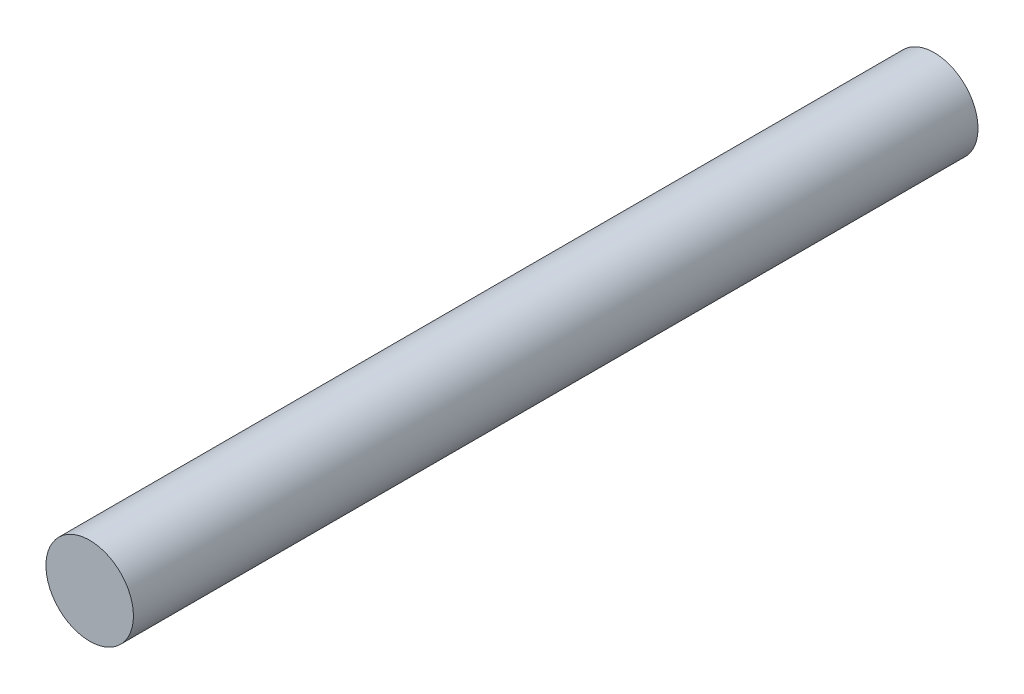
ISO-10303-21;
HEADER;
FILE_DESCRIPTION(('STEP AP214'),'2;1');
FILE_NAME('part.step','',(''),(''),'','','');
FILE_SCHEMA(('AUTOMOTIVE_DESIGN { 1 0 10303 214 1 1 1 1 }'));
ENDSEC;
DATA;
#1=APPLICATION_CONTEXT('core data for automotive mechanical design processes');
#2=APPLICATION_PROTOCOL_DEFINITION('international standard','automotive_design',2000,#1);
#3=PRODUCT_CONTEXT('',#1,'mechanical');
#4=PRODUCT('Part','Part','',(#3));
#5=PRODUCT_RELATED_PRODUCT_CATEGORY('part','',(#4));
#6=PRODUCT_DEFINITION_FORMATION('','',#4);
#7=PRODUCT_DEFINITION_CONTEXT('part definition',#1,'design');
#8=PRODUCT_DEFINITION('design','',#6,#7);
#9=PRODUCT_DEFINITION_SHAPE('','',#8);
#10=(LENGTH_UNIT() NAMED_UNIT(*) SI_UNIT(.MILLI.,.METRE.));
#11=(NAMED_UNIT(*) PLANE_ANGLE_UNIT() SI_UNIT($,.RADIAN.));
#12=(NAMED_UNIT(*) SI_UNIT($,.STERADIAN.) SOLID_ANGLE_UNIT());
#13=UNCERTAINTY_MEASURE_WITH_UNIT(LENGTH_MEASURE(1.E-05),#10,'distance_accuracy_value','');
#14=(GEOMETRIC_REPRESENTATION_CONTEXT(3) GLOBAL_UNCERTAINTY_ASSIGNED_CONTEXT((#13)) GLOBAL_UNIT_ASSIGNED_CONTEXT((#10,
#11,#12)) REPRESENTATION_CONTEXT('',''));
#15=CARTESIAN_POINT('',(0.,0.,0.));
#16=DIRECTION('',(0.,0.,1.));
#17=DIRECTION('',(1.,0.,0.));
#18=AXIS2_PLACEMENT_3D('',#15,#16,#17);
#19=CARTESIAN_POINT('',(0.,0.,48.25));
#20=DIRECTION('',(0.,0.,-1.));
#21=DIRECTION('',(-1.,0.,0.));
#22=AXIS2_PLACEMENT_3D('',#19,#20,#21);
#23=CYLINDRICAL_SURFACE('',#22,2.5);
#24=CARTESIAN_POINT('',(0.,0.,48.25));
#25=DIRECTION('',(0.,0.,1.));
#26=DIRECTION('',(1.,0.,0.));
#27=AXIS2_PLACEMENT_3D('',#24,#25,#26);
#28=CIRCLE('',#27,2.5);
#29=CARTESIAN_POINT('',(2.5,0.,48.25));
#30=VERTEX_POINT('',#29);
#31=EDGE_CURVE('E10',#30,#30,#28,.T.);
#32=ORIENTED_EDGE('',*,*,#31,.F.);
#33=EDGE_LOOP('',(#32));
#34=FACE_BOUND('',#33,.T.);
#35=CARTESIAN_POINT('',(0.,0.,0.));
#36=DIRECTION('',(0.,0.,1.));
#37=DIRECTION('',(1.,0.,0.));
#38=AXIS2_PLACEMENT_3D('',#35,#36,#37);
#39=CIRCLE('',#38,2.5);
#40=CARTESIAN_POINT('',(2.5,0.,0.));
#41=VERTEX_POINT('',#40);
#42=EDGE_CURVE('E33',#41,#41,#39,.T.);
#43=ORIENTED_EDGE('',*,*,#42,.T.);
#44=EDGE_LOOP('',(#43));
#45=FACE_BOUND('',#44,.T.);
#46=ADVANCED_FACE('F30',(#34,#45),#23,.T.);
#47=CARTESIAN_POINT('',(0.,0.,48.25));
#48=DIRECTION('',(0.,0.,1.));
#49=DIRECTION('',(1.,0.,0.));
#50=AXIS2_PLACEMENT_3D('',#47,#48,#49);
#51=PLANE('',#50);
#52=ORIENTED_EDGE('',*,*,#31,.T.);
#53=EDGE_LOOP('',(#52));
#54=FACE_BOUND('',#53,.T.);
#55=ADVANCED_FACE('F45',(#54),#51,.T.);
#56=CARTESIAN_POINT('',(0.,0.,0.));
#57=DIRECTION('',(0.,0.,1.));
#58=DIRECTION('',(1.,0.,0.));
#59=AXIS2_PLACEMENT_3D('',#56,#57,#58);
#60=PLANE('',#59);
#61=ORIENTED_EDGE('',*,*,#42,.F.);
#62=EDGE_LOOP('',(#61));
#63=FACE_BOUND('',#62,.T.);
#64=ADVANCED_FACE('F43',(#63),#60,.F.);
#65=CLOSED_SHELL('',(#46,#55,#64));
#66=MANIFOLD_SOLID_BREP('B2',#65);
#67=ADVANCED_BREP_SHAPE_REPRESENTATION('',(#18,#66),#14);
#68=SHAPE_DEFINITION_REPRESENTATION(#9,#67);
ENDSEC;
END-ISO-10303-21;
